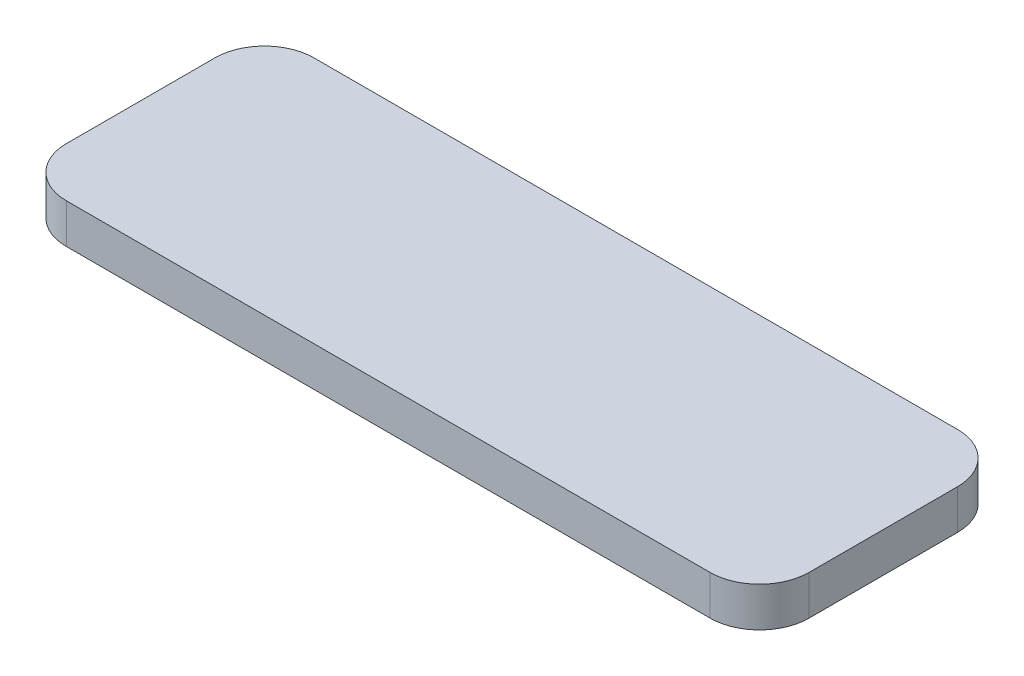
ISO-10303-21;
HEADER;
FILE_DESCRIPTION(('STEP AP214'),'2;1');
FILE_NAME('part.step','',(''),(''),'','','');
FILE_SCHEMA(('AUTOMOTIVE_DESIGN { 1 0 10303 214 1 1 1 1 }'));
ENDSEC;
DATA;
#1=APPLICATION_CONTEXT('core data for automotive mechanical design processes');
#2=APPLICATION_PROTOCOL_DEFINITION('international standard','automotive_design',2000,#1);
#3=PRODUCT_CONTEXT('',#1,'mechanical');
#4=PRODUCT('Part','Part','',(#3));
#5=PRODUCT_RELATED_PRODUCT_CATEGORY('part','',(#4));
#6=PRODUCT_DEFINITION_FORMATION('','',#4);
#7=PRODUCT_DEFINITION_CONTEXT('part definition',#1,'design');
#8=PRODUCT_DEFINITION('design','',#6,#7);
#9=PRODUCT_DEFINITION_SHAPE('','',#8);
#10=(LENGTH_UNIT() NAMED_UNIT(*) SI_UNIT(.MILLI.,.METRE.));
#11=(NAMED_UNIT(*) PLANE_ANGLE_UNIT() SI_UNIT($,.RADIAN.));
#12=(NAMED_UNIT(*) SI_UNIT($,.STERADIAN.) SOLID_ANGLE_UNIT());
#13=UNCERTAINTY_MEASURE_WITH_UNIT(LENGTH_MEASURE(1.E-05),#10,'distance_accuracy_value','');
#14=(GEOMETRIC_REPRESENTATION_CONTEXT(3) GLOBAL_UNCERTAINTY_ASSIGNED_CONTEXT((#13)) GLOBAL_UNIT_ASSIGNED_CONTEXT((#10,
#11,#12)) REPRESENTATION_CONTEXT('',''));
#15=CARTESIAN_POINT('',(0.,0.,0.));
#16=DIRECTION('',(0.,0.,1.));
#17=DIRECTION('',(1.,0.,0.));
#18=AXIS2_PLACEMENT_3D('',#15,#16,#17);
#19=CARTESIAN_POINT('',(-33.0811009625399,8.,-39.6457817823621));
#20=DIRECTION('',(0.,-1.,0.));
#21=DIRECTION('',(0.,0.,-1.));
#22=AXIS2_PLACEMENT_3D('',#19,#20,#21);
#23=CYLINDRICAL_SURFACE('',#22,10.);
#24=CARTESIAN_POINT('',(-33.0811009625399,0.,-39.6457817823621));
#25=DIRECTION('',(0.,1.,0.));
#26=DIRECTION('',(0.,0.,1.));
#27=AXIS2_PLACEMENT_3D('',#24,#25,#26);
#28=CIRCLE('',#27,10.);
#29=CARTESIAN_POINT('',(-33.0811009625398,0.,-49.6457817823621));
#30=VERTEX_POINT('',#29);
#31=CARTESIAN_POINT('',(-43.0811009625399,0.,-39.645781782362));
#32=VERTEX_POINT('',#31);
#33=EDGE_CURVE('E144',#30,#32,#28,.T.);
#34=ORIENTED_EDGE('',*,*,#33,.T.);
#35=DIRECTION('',(0.,-1.,0.));
#36=VECTOR('',#35,1.);
#37=CARTESIAN_POINT('',(-43.0811009625399,8.,-39.645781782362));
#38=LINE('',#37,#36);
#39=CARTESIAN_POINT('',(-43.0811009625399,8.,-39.645781782362));
#40=VERTEX_POINT('',#39);
#41=EDGE_CURVE('E11',#40,#32,#38,.T.);
#42=ORIENTED_EDGE('',*,*,#41,.F.);
#43=CARTESIAN_POINT('',(-33.0811009625399,8.,-39.6457817823621));
#44=DIRECTION('',(0.,1.,0.));
#45=DIRECTION('',(0.,0.,1.));
#46=AXIS2_PLACEMENT_3D('',#43,#44,#45);
#47=CIRCLE('',#46,10.);
#48=CARTESIAN_POINT('',(-33.0811009625398,8.,-49.6457817823621));
#49=VERTEX_POINT('',#48);
#50=EDGE_CURVE('E169',#49,#40,#47,.T.);
#51=ORIENTED_EDGE('',*,*,#50,.F.);
#52=DIRECTION('',(0.,-1.,0.));
#53=VECTOR('',#52,1.);
#54=CARTESIAN_POINT('',(-33.0811009625398,8.,-49.6457817823621));
#55=LINE('',#54,#53);
#56=EDGE_CURVE('E60',#49,#30,#55,.T.);
#57=ORIENTED_EDGE('',*,*,#56,.T.);
#58=EDGE_LOOP('',(#34,#42,#51,#57));
#59=FACE_BOUND('',#58,.T.);
#60=ADVANCED_FACE('F43',(#59),#23,.T.);
#61=CARTESIAN_POINT('',(-43.0811009625399,8.,-39.645781782362));
#62=DIRECTION('',(1.,0.,0.));
#63=DIRECTION('',(0.,0.,-1.));
#64=AXIS2_PLACEMENT_3D('',#61,#62,#63);
#65=PLANE('',#64);
#66=DIRECTION('',(0.,0.,1.));
#67=VECTOR('',#66,1.);
#68=CARTESIAN_POINT('',(-43.0811009625399,0.,-39.645781782362));
#69=LINE('',#68,#67);
#70=CARTESIAN_POINT('',(-43.0811009625399,0.,-9.64578178236213));
#71=VERTEX_POINT('',#70);
#72=EDGE_CURVE('E147',#32,#71,#69,.T.);
#73=ORIENTED_EDGE('',*,*,#72,.T.);
#74=DIRECTION('',(0.,-1.,0.));
#75=VECTOR('',#74,1.);
#76=CARTESIAN_POINT('',(-43.0811009625399,8.,-9.64578178236213));
#77=LINE('',#76,#75);
#78=CARTESIAN_POINT('',(-43.0811009625399,8.,-9.64578178236213));
#79=VERTEX_POINT('',#78);
#80=EDGE_CURVE('E52',#79,#71,#77,.T.);
#81=ORIENTED_EDGE('',*,*,#80,.F.);
#82=DIRECTION('',(0.,0.,1.));
#83=VECTOR('',#82,1.);
#84=CARTESIAN_POINT('',(-43.0811009625399,8.,-39.645781782362));
#85=LINE('',#84,#83);
#86=EDGE_CURVE('E98',#40,#79,#85,.T.);
#87=ORIENTED_EDGE('',*,*,#86,.F.);
#88=ORIENTED_EDGE('',*,*,#41,.T.);
#89=EDGE_LOOP('',(#73,#81,#87,#88));
#90=FACE_BOUND('',#89,.T.);
#91=ADVANCED_FACE('F212',(#90),#65,.F.);
#92=CARTESIAN_POINT('',(-33.0811009625399,8.,-9.64578178236205));
#93=DIRECTION('',(0.,-1.,0.));
#94=DIRECTION('',(0.,0.,-1.));
#95=AXIS2_PLACEMENT_3D('',#92,#93,#94);
#96=CYLINDRICAL_SURFACE('',#95,10.);
#97=CARTESIAN_POINT('',(-33.0811009625399,0.,-9.64578178236205));
#98=DIRECTION('',(0.,1.,0.));
#99=DIRECTION('',(0.,0.,1.));
#100=AXIS2_PLACEMENT_3D('',#97,#98,#99);
#101=CIRCLE('',#100,10.);
#102=CARTESIAN_POINT('',(-33.0811009625398,0.,0.354218217637946));
#103=VERTEX_POINT('',#102);
#104=EDGE_CURVE('E150',#71,#103,#101,.T.);
#105=ORIENTED_EDGE('',*,*,#104,.T.);
#106=DIRECTION('',(0.,-1.,0.));
#107=VECTOR('',#106,1.);
#108=CARTESIAN_POINT('',(-33.0811009625398,8.,0.354218217637946));
#109=LINE('',#108,#107);
#110=CARTESIAN_POINT('',(-33.0811009625398,8.,0.354218217637946));
#111=VERTEX_POINT('',#110);
#112=EDGE_CURVE('E180',#111,#103,#109,.T.);
#113=ORIENTED_EDGE('',*,*,#112,.F.);
#114=CARTESIAN_POINT('',(-33.0811009625399,8.,-9.64578178236205));
#115=DIRECTION('',(0.,1.,0.));
#116=DIRECTION('',(0.,0.,1.));
#117=AXIS2_PLACEMENT_3D('',#114,#115,#116);
#118=CIRCLE('',#117,10.);
#119=EDGE_CURVE('E190',#79,#111,#118,.T.);
#120=ORIENTED_EDGE('',*,*,#119,.F.);
#121=ORIENTED_EDGE('',*,*,#80,.T.);
#122=EDGE_LOOP('',(#105,#113,#120,#121));
#123=FACE_BOUND('',#122,.T.);
#124=ADVANCED_FACE('F188',(#123),#96,.T.);
#125=CARTESIAN_POINT('',(-33.0811009625398,8.,0.354218217637946));
#126=DIRECTION('',(0.,0.,-1.));
#127=DIRECTION('',(-1.,0.,0.));
#128=AXIS2_PLACEMENT_3D('',#125,#126,#127);
#129=PLANE('',#128);
#130=DIRECTION('',(1.,0.,0.));
#131=VECTOR('',#130,1.);
#132=CARTESIAN_POINT('',(-33.0811009625398,0.,0.354218217637946));
#133=LINE('',#132,#131);
#134=CARTESIAN_POINT('',(96.91889903746,0.,0.354218217637944));
#135=VERTEX_POINT('',#134);
#136=EDGE_CURVE('E153',#103,#135,#133,.T.);
#137=ORIENTED_EDGE('',*,*,#136,.T.);
#138=DIRECTION('',(0.,-1.,0.));
#139=VECTOR('',#138,1.);
#140=CARTESIAN_POINT('',(96.91889903746,8.,0.354218217637944));
#141=LINE('',#140,#139);
#142=CARTESIAN_POINT('',(96.91889903746,8.,0.354218217637944));
#143=VERTEX_POINT('',#142);
#144=EDGE_CURVE('E176',#143,#135,#141,.T.);
#145=ORIENTED_EDGE('',*,*,#144,.F.);
#146=DIRECTION('',(1.,0.,0.));
#147=VECTOR('',#146,1.);
#148=CARTESIAN_POINT('',(-33.0811009625398,8.,0.354218217637946));
#149=LINE('',#148,#147);
#150=EDGE_CURVE('E202',#111,#143,#149,.T.);
#151=ORIENTED_EDGE('',*,*,#150,.F.);
#152=ORIENTED_EDGE('',*,*,#112,.T.);
#153=EDGE_LOOP('',(#137,#145,#151,#152));
#154=FACE_BOUND('',#153,.T.);
#155=ADVANCED_FACE('F197',(#154),#129,.F.);
#156=CARTESIAN_POINT('',(96.9188990374601,8.,-9.64578178236205));
#157=DIRECTION('',(0.,-1.,0.));
#158=DIRECTION('',(0.,0.,-1.));
#159=AXIS2_PLACEMENT_3D('',#156,#157,#158);
#160=CYLINDRICAL_SURFACE('',#159,10.);
#161=CARTESIAN_POINT('',(96.9188990374601,0.,-9.64578178236205));
#162=DIRECTION('',(0.,1.,0.));
#163=DIRECTION('',(0.,0.,1.));
#164=AXIS2_PLACEMENT_3D('',#161,#162,#163);
#165=CIRCLE('',#164,10.);
#166=CARTESIAN_POINT('',(106.91889903746,0.,-9.64578178236212));
#167=VERTEX_POINT('',#166);
#168=EDGE_CURVE('E156',#135,#167,#165,.T.);
#169=ORIENTED_EDGE('',*,*,#168,.T.);
#170=DIRECTION('',(0.,-1.,0.));
#171=VECTOR('',#170,1.);
#172=CARTESIAN_POINT('',(106.91889903746,8.,-9.64578178236212));
#173=LINE('',#172,#171);
#174=CARTESIAN_POINT('',(106.91889903746,8.,-9.64578178236212));
#175=VERTEX_POINT('',#174);
#176=EDGE_CURVE('E124',#175,#167,#173,.T.);
#177=ORIENTED_EDGE('',*,*,#176,.F.);
#178=CARTESIAN_POINT('',(96.9188990374601,8.,-9.64578178236205));
#179=DIRECTION('',(0.,1.,0.));
#180=DIRECTION('',(0.,0.,1.));
#181=AXIS2_PLACEMENT_3D('',#178,#179,#180);
#182=CIRCLE('',#181,10.);
#183=EDGE_CURVE('E132',#143,#175,#182,.T.);
#184=ORIENTED_EDGE('',*,*,#183,.F.);
#185=ORIENTED_EDGE('',*,*,#144,.T.);
#186=EDGE_LOOP('',(#169,#177,#184,#185));
#187=FACE_BOUND('',#186,.T.);
#188=ADVANCED_FACE('F200',(#187),#160,.T.);
#189=CARTESIAN_POINT('',(106.91889903746,8.,-39.645781782362));
#190=DIRECTION('',(1.,0.,0.));
#191=DIRECTION('',(0.,0.,-1.));
#192=AXIS2_PLACEMENT_3D('',#189,#190,#191);
#193=PLANE('',#192);
#194=DIRECTION('',(0.,0.,1.));
#195=VECTOR('',#194,1.);
#196=CARTESIAN_POINT('',(106.91889903746,0.,-39.645781782362));
#197=LINE('',#196,#195);
#198=CARTESIAN_POINT('',(106.91889903746,0.,-39.645781782362));
#199=VERTEX_POINT('',#198);
#200=EDGE_CURVE('E119',#199,#167,#197,.T.);
#201=ORIENTED_EDGE('',*,*,#200,.F.);
#202=DIRECTION('',(0.,-1.,0.));
#203=VECTOR('',#202,1.);
#204=CARTESIAN_POINT('',(106.91889903746,8.,-39.645781782362));
#205=LINE('',#204,#203);
#206=CARTESIAN_POINT('',(106.91889903746,8.,-39.645781782362));
#207=VERTEX_POINT('',#206);
#208=EDGE_CURVE('E114',#207,#199,#205,.T.);
#209=ORIENTED_EDGE('',*,*,#208,.F.);
#210=DIRECTION('',(0.,0.,1.));
#211=VECTOR('',#210,1.);
#212=CARTESIAN_POINT('',(106.91889903746,8.,-39.645781782362));
#213=LINE('',#212,#211);
#214=EDGE_CURVE('E117',#207,#175,#213,.T.);
#215=ORIENTED_EDGE('',*,*,#214,.T.);
#216=ORIENTED_EDGE('',*,*,#176,.T.);
#217=EDGE_LOOP('',(#201,#209,#215,#216));
#218=FACE_BOUND('',#217,.T.);
#219=ADVANCED_FACE('F116',(#218),#193,.T.);
#220=CARTESIAN_POINT('',(96.9188990374601,8.,-39.6457817823621));
#221=DIRECTION('',(0.,-1.,0.));
#222=DIRECTION('',(0.,0.,-1.));
#223=AXIS2_PLACEMENT_3D('',#220,#221,#222);
#224=CYLINDRICAL_SURFACE('',#223,10.);
#225=CARTESIAN_POINT('',(96.9188990374601,0.,-39.6457817823621));
#226=DIRECTION('',(0.,-1.,0.));
#227=DIRECTION('',(0.,0.,-1.));
#228=AXIS2_PLACEMENT_3D('',#225,#226,#227);
#229=CIRCLE('',#228,10.);
#230=CARTESIAN_POINT('',(96.91889903746,0.,-49.6457817823621));
#231=VERTEX_POINT('',#230);
#232=EDGE_CURVE('E162',#231,#199,#229,.T.);
#233=ORIENTED_EDGE('',*,*,#232,.F.);
#234=DIRECTION('',(0.,-1.,0.));
#235=VECTOR('',#234,1.);
#236=CARTESIAN_POINT('',(96.91889903746,8.,-49.6457817823621));
#237=LINE('',#236,#235);
#238=CARTESIAN_POINT('',(96.91889903746,8.,-49.6457817823621));
#239=VERTEX_POINT('',#238);
#240=EDGE_CURVE('E86',#239,#231,#237,.T.);
#241=ORIENTED_EDGE('',*,*,#240,.F.);
#242=CARTESIAN_POINT('',(96.9188990374601,8.,-39.6457817823621));
#243=DIRECTION('',(0.,-1.,0.));
#244=DIRECTION('',(0.,0.,-1.));
#245=AXIS2_PLACEMENT_3D('',#242,#243,#244);
#246=CIRCLE('',#245,10.);
#247=EDGE_CURVE('E130',#239,#207,#246,.T.);
#248=ORIENTED_EDGE('',*,*,#247,.T.);
#249=ORIENTED_EDGE('',*,*,#208,.T.);
#250=EDGE_LOOP('',(#233,#241,#248,#249));
#251=FACE_BOUND('',#250,.T.);
#252=ADVANCED_FACE('F136',(#251),#224,.T.);
#253=CARTESIAN_POINT('',(-33.0811009625398,8.,-49.6457817823621));
#254=DIRECTION('',(0.,0.,-1.));
#255=DIRECTION('',(-1.,0.,0.));
#256=AXIS2_PLACEMENT_3D('',#253,#254,#255);
#257=PLANE('',#256);
#258=DIRECTION('',(1.,0.,0.));
#259=VECTOR('',#258,1.);
#260=CARTESIAN_POINT('',(-33.0811009625398,0.,-49.6457817823621));
#261=LINE('',#260,#259);
#262=EDGE_CURVE('E165',#30,#231,#261,.T.);
#263=ORIENTED_EDGE('',*,*,#262,.F.);
#264=ORIENTED_EDGE('',*,*,#56,.F.);
#265=DIRECTION('',(1.,0.,0.));
#266=VECTOR('',#265,1.);
#267=CARTESIAN_POINT('',(-33.0811009625398,8.,-49.6457817823621));
#268=LINE('',#267,#266);
#269=EDGE_CURVE('E138',#49,#239,#268,.T.);
#270=ORIENTED_EDGE('',*,*,#269,.T.);
#271=ORIENTED_EDGE('',*,*,#240,.T.);
#272=EDGE_LOOP('',(#263,#264,#270,#271));
#273=FACE_BOUND('',#272,.T.);
#274=ADVANCED_FACE('F228',(#273),#257,.T.);
#275=CARTESIAN_POINT('',(-33.0811009625399,8.,-39.6457817823621));
#276=DIRECTION('',(0.,1.,0.));
#277=DIRECTION('',(0.,0.,1.));
#278=AXIS2_PLACEMENT_3D('',#275,#276,#277);
#279=PLANE('',#278);
#280=ORIENTED_EDGE('',*,*,#50,.T.);
#281=ORIENTED_EDGE('',*,*,#86,.T.);
#282=ORIENTED_EDGE('',*,*,#119,.T.);
#283=ORIENTED_EDGE('',*,*,#150,.T.);
#284=ORIENTED_EDGE('',*,*,#183,.T.);
#285=ORIENTED_EDGE('',*,*,#214,.F.);
#286=ORIENTED_EDGE('',*,*,#247,.F.);
#287=ORIENTED_EDGE('',*,*,#269,.F.);
#288=EDGE_LOOP('',(#280,#281,#282,#283,#284,#285,#286,#287));
#289=FACE_BOUND('',#288,.T.);
#290=ADVANCED_FACE('F128',(#289),#279,.T.);
#291=CARTESIAN_POINT('',(-33.0811009625399,0.,-39.6457817823621));
#292=DIRECTION('',(0.,1.,0.));
#293=DIRECTION('',(0.,0.,1.));
#294=AXIS2_PLACEMENT_3D('',#291,#292,#293);
#295=PLANE('',#294);
#296=ORIENTED_EDGE('',*,*,#33,.F.);
#297=ORIENTED_EDGE('',*,*,#262,.T.);
#298=ORIENTED_EDGE('',*,*,#232,.T.);
#299=ORIENTED_EDGE('',*,*,#200,.T.);
#300=ORIENTED_EDGE('',*,*,#168,.F.);
#301=ORIENTED_EDGE('',*,*,#136,.F.);
#302=ORIENTED_EDGE('',*,*,#104,.F.);
#303=ORIENTED_EDGE('',*,*,#72,.F.);
#304=EDGE_LOOP('',(#296,#297,#298,#299,#300,#301,#302,#303));
#305=FACE_BOUND('',#304,.T.);
#306=ADVANCED_FACE('F193',(#305),#295,.F.);
#307=CLOSED_SHELL('',(#60,#91,#124,#155,#188,#219,#252,#274,#290,#306));
#308=MANIFOLD_SOLID_BREP('B2',#307);
#309=ADVANCED_BREP_SHAPE_REPRESENTATION('',(#18,#308),#14);
#310=SHAPE_DEFINITION_REPRESENTATION(#9,#309);
ENDSEC;
END-ISO-10303-21;
